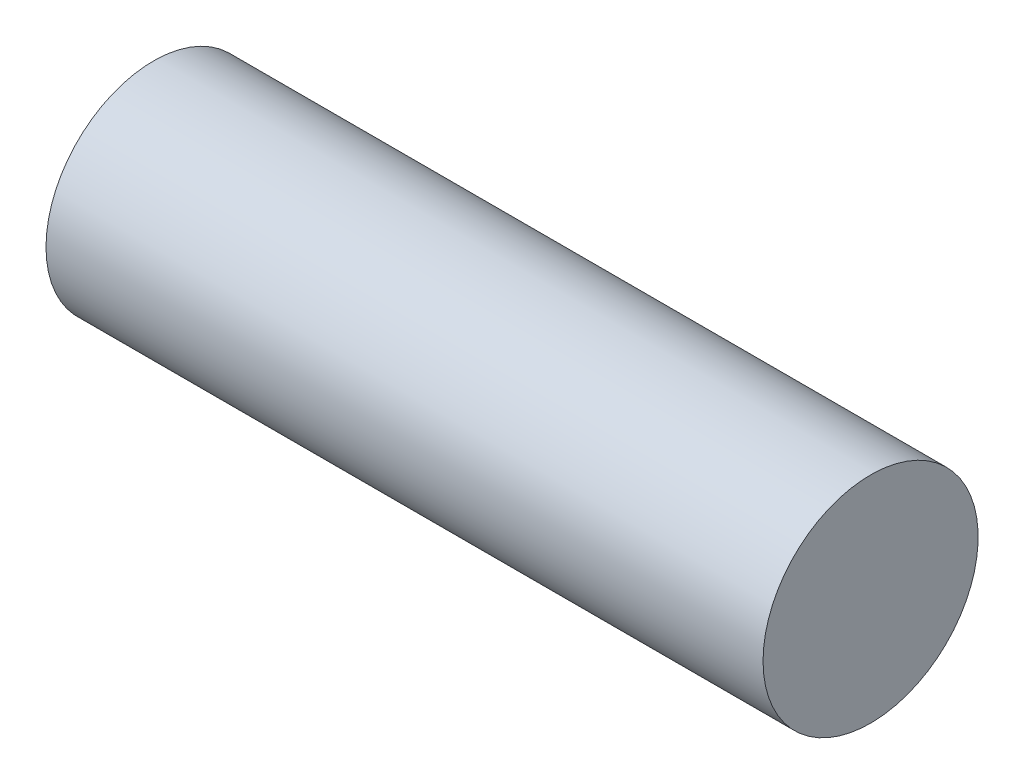
ISO-10303-21;
HEADER;
FILE_DESCRIPTION(('STEP AP214'),'2;1');
FILE_NAME('part.step','',(''),(''),'','','');
FILE_SCHEMA(('AUTOMOTIVE_DESIGN { 1 0 10303 214 1 1 1 1 }'));
ENDSEC;
DATA;
#1=APPLICATION_CONTEXT('core data for automotive mechanical design processes');
#2=APPLICATION_PROTOCOL_DEFINITION('international standard','automotive_design',2000,#1);
#3=PRODUCT_CONTEXT('',#1,'mechanical');
#4=PRODUCT('Part','Part','',(#3));
#5=PRODUCT_RELATED_PRODUCT_CATEGORY('part','',(#4));
#6=PRODUCT_DEFINITION_FORMATION('','',#4);
#7=PRODUCT_DEFINITION_CONTEXT('part definition',#1,'design');
#8=PRODUCT_DEFINITION('design','',#6,#7);
#9=PRODUCT_DEFINITION_SHAPE('','',#8);
#10=(LENGTH_UNIT() NAMED_UNIT(*) SI_UNIT(.MILLI.,.METRE.));
#11=(NAMED_UNIT(*) PLANE_ANGLE_UNIT() SI_UNIT($,.RADIAN.));
#12=(NAMED_UNIT(*) SI_UNIT($,.STERADIAN.) SOLID_ANGLE_UNIT());
#13=UNCERTAINTY_MEASURE_WITH_UNIT(LENGTH_MEASURE(1.E-05),#10,'distance_accuracy_value','');
#14=(GEOMETRIC_REPRESENTATION_CONTEXT(3) GLOBAL_UNCERTAINTY_ASSIGNED_CONTEXT((#13)) GLOBAL_UNIT_ASSIGNED_CONTEXT((#10,
#11,#12)) REPRESENTATION_CONTEXT('',''));
#15=CARTESIAN_POINT('',(0.,0.,0.));
#16=DIRECTION('',(0.,0.,1.));
#17=DIRECTION('',(1.,0.,0.));
#18=AXIS2_PLACEMENT_3D('',#15,#16,#17);
#19=CARTESIAN_POINT('',(0.,0.,0.));
#20=DIRECTION('',(-1.,0.,0.));
#21=DIRECTION('',(0.,0.,1.));
#22=AXIS2_PLACEMENT_3D('',#19,#20,#21);
#23=PLANE('',#22);
#24=CARTESIAN_POINT('',(0.,6.,0.));
#25=DIRECTION('',(-1.,0.,0.));
#26=DIRECTION('',(0.,0.,1.));
#27=AXIS2_PLACEMENT_3D('',#24,#25,#26);
#28=CIRCLE('',#27,6.);
#29=CARTESIAN_POINT('',(0.,6.,6.));
#30=VERTEX_POINT('',#29);
#31=EDGE_CURVE('E41',#30,#30,#28,.T.);
#32=ORIENTED_EDGE('',*,*,#31,.T.);
#33=EDGE_LOOP('',(#32));
#34=FACE_BOUND('',#33,.T.);
#35=ADVANCED_FACE('F35',(#34),#23,.T.);
#36=CARTESIAN_POINT('',(40.,0.,0.));
#37=DIRECTION('',(1.,0.,0.));
#38=DIRECTION('',(0.,0.,-1.));
#39=AXIS2_PLACEMENT_3D('',#36,#37,#38);
#40=PLANE('',#39);
#41=CARTESIAN_POINT('',(40.,6.,0.));
#42=DIRECTION('',(-1.,0.,0.));
#43=DIRECTION('',(0.,0.,1.));
#44=AXIS2_PLACEMENT_3D('',#41,#42,#43);
#45=CIRCLE('',#44,6.);
#46=CARTESIAN_POINT('',(40.,6.,6.));
#47=VERTEX_POINT('',#46);
#48=EDGE_CURVE('E10',#47,#47,#45,.T.);
#49=ORIENTED_EDGE('',*,*,#48,.F.);
#50=EDGE_LOOP('',(#49));
#51=FACE_BOUND('',#50,.T.);
#52=ADVANCED_FACE('F50',(#51),#40,.T.);
#53=CARTESIAN_POINT('',(0.,6.,0.));
#54=DIRECTION('',(-1.,0.,0.));
#55=DIRECTION('',(0.,0.,1.));
#56=AXIS2_PLACEMENT_3D('',#53,#54,#55);
#57=CYLINDRICAL_SURFACE('',#56,6.);
#58=ORIENTED_EDGE('',*,*,#48,.T.);
#59=EDGE_LOOP('',(#58));
#60=FACE_BOUND('',#59,.T.);
#61=ORIENTED_EDGE('',*,*,#31,.F.);
#62=EDGE_LOOP('',(#61));
#63=FACE_BOUND('',#62,.T.);
#64=ADVANCED_FACE('F48',(#60,#63),#57,.T.);
#65=CLOSED_SHELL('',(#35,#52,#64));
#66=MANIFOLD_SOLID_BREP('B2',#65);
#67=ADVANCED_BREP_SHAPE_REPRESENTATION('',(#18,#66),#14);
#68=SHAPE_DEFINITION_REPRESENTATION(#9,#67);
ENDSEC;
END-ISO-10303-21;
